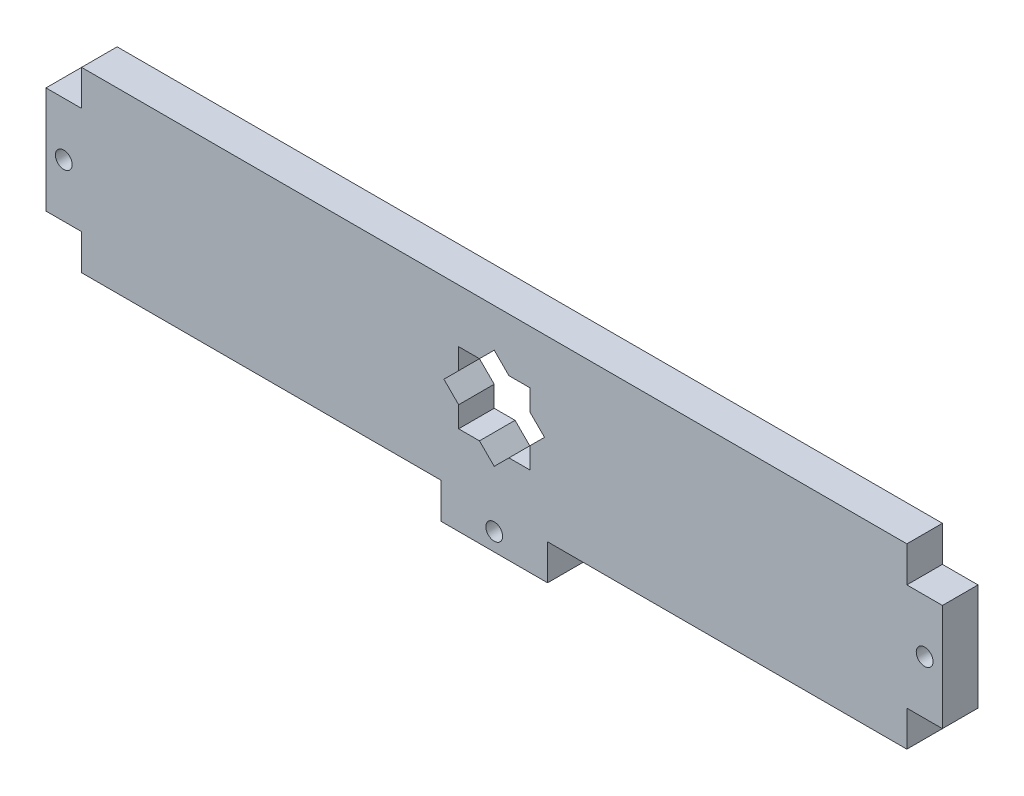
ISO-10303-21;
HEADER;
FILE_DESCRIPTION(('STEP AP214'),'2;1');
FILE_NAME('part.step','',(''),(''),'','','');
FILE_SCHEMA(('AUTOMOTIVE_DESIGN { 1 0 10303 214 1 1 1 1 }'));
ENDSEC;
DATA;
#1=APPLICATION_CONTEXT('core data for automotive mechanical design processes');
#2=APPLICATION_PROTOCOL_DEFINITION('international standard','automotive_design',2000,#1);
#3=PRODUCT_CONTEXT('',#1,'mechanical');
#4=PRODUCT('Part','Part','',(#3));
#5=PRODUCT_RELATED_PRODUCT_CATEGORY('part','',(#4));
#6=PRODUCT_DEFINITION_FORMATION('','',#4);
#7=PRODUCT_DEFINITION_CONTEXT('part definition',#1,'design');
#8=PRODUCT_DEFINITION('design','',#6,#7);
#9=PRODUCT_DEFINITION_SHAPE('','',#8);
#10=(LENGTH_UNIT() NAMED_UNIT(*) SI_UNIT(.MILLI.,.METRE.));
#11=(NAMED_UNIT(*) PLANE_ANGLE_UNIT() SI_UNIT($,.RADIAN.));
#12=(NAMED_UNIT(*) SI_UNIT($,.STERADIAN.) SOLID_ANGLE_UNIT());
#13=UNCERTAINTY_MEASURE_WITH_UNIT(LENGTH_MEASURE(1.E-05),#10,'distance_accuracy_value','');
#14=(GEOMETRIC_REPRESENTATION_CONTEXT(3) GLOBAL_UNCERTAINTY_ASSIGNED_CONTEXT((#13)) GLOBAL_UNIT_ASSIGNED_CONTEXT((#10,
#11,#12)) REPRESENTATION_CONTEXT('',''));
#15=CARTESIAN_POINT('',(0.,0.,0.));
#16=DIRECTION('',(0.,0.,1.));
#17=DIRECTION('',(1.,0.,0.));
#18=AXIS2_PLACEMENT_3D('',#15,#16,#17);
#19=CARTESIAN_POINT('',(-73.66,-15.875,-6.35));
#20=DIRECTION('',(0.,-1.,0.));
#21=DIRECTION('',(0.,0.,-1.));
#22=AXIS2_PLACEMENT_3D('',#19,#20,#21);
#23=PLANE('',#22);
#24=DIRECTION('',(1.,0.,0.));
#25=VECTOR('',#24,1.);
#26=CARTESIAN_POINT('',(-73.66,-15.875,-6.35));
#27=LINE('',#26,#25);
#28=CARTESIAN_POINT('',(-73.66,-15.875,-6.35));
#29=VERTEX_POINT('',#28);
#30=CARTESIAN_POINT('',(-9.52500000000007,-15.875,-6.35));
#31=VERTEX_POINT('',#30);
#32=EDGE_CURVE('E392',#29,#31,#27,.T.);
#33=ORIENTED_EDGE('',*,*,#32,.T.);
#34=DIRECTION('',(0.,0.,1.));
#35=VECTOR('',#34,1.);
#36=CARTESIAN_POINT('',(-9.52500000000007,-15.875,-6.35));
#37=LINE('',#36,#35);
#38=CARTESIAN_POINT('',(-9.52500000000007,-15.875,0.));
#39=VERTEX_POINT('',#38);
#40=EDGE_CURVE('E363',#31,#39,#37,.T.);
#41=ORIENTED_EDGE('',*,*,#40,.T.);
#42=DIRECTION('',(1.,0.,0.));
#43=VECTOR('',#42,1.);
#44=CARTESIAN_POINT('',(-73.66,-15.875,0.));
#45=LINE('',#44,#43);
#46=CARTESIAN_POINT('',(-73.66,-15.875,0.));
#47=VERTEX_POINT('',#46);
#48=EDGE_CURVE('E489',#47,#39,#45,.T.);
#49=ORIENTED_EDGE('',*,*,#48,.F.);
#50=DIRECTION('',(0.,0.,1.));
#51=VECTOR('',#50,1.);
#52=CARTESIAN_POINT('',(-73.66,-15.875,-6.35));
#53=LINE('',#52,#51);
#54=EDGE_CURVE('E42',#29,#47,#53,.T.);
#55=ORIENTED_EDGE('',*,*,#54,.F.);
#56=EDGE_LOOP('',(#33,#41,#49,#55));
#57=FACE_BOUND('',#56,.T.);
#58=ADVANCED_FACE('F33',(#57),#23,.T.);
#59=CARTESIAN_POINT('',(73.66,-15.875,-6.35));
#60=DIRECTION('',(1.,0.,0.));
#61=DIRECTION('',(0.,0.,-1.));
#62=AXIS2_PLACEMENT_3D('',#59,#60,#61);
#63=PLANE('',#62);
#64=DIRECTION('',(0.,1.,0.));
#65=VECTOR('',#64,1.);
#66=CARTESIAN_POINT('',(73.66,-15.875,-6.35));
#67=LINE('',#66,#65);
#68=CARTESIAN_POINT('',(73.66,-15.875,-6.35));
#69=VERTEX_POINT('',#68);
#70=CARTESIAN_POINT('',(73.66,-9.525,-6.35));
#71=VERTEX_POINT('',#70);
#72=EDGE_CURVE('E549',#69,#71,#67,.T.);
#73=ORIENTED_EDGE('',*,*,#72,.T.);
#74=DIRECTION('',(0.,0.,1.));
#75=VECTOR('',#74,1.);
#76=CARTESIAN_POINT('',(73.66,-9.525,-6.35));
#77=LINE('',#76,#75);
#78=CARTESIAN_POINT('',(73.66,-9.525,0.));
#79=VERTEX_POINT('',#78);
#80=EDGE_CURVE('E474',#71,#79,#77,.T.);
#81=ORIENTED_EDGE('',*,*,#80,.T.);
#82=DIRECTION('',(0.,1.,0.));
#83=VECTOR('',#82,1.);
#84=CARTESIAN_POINT('',(73.66,-15.875,0.));
#85=LINE('',#84,#83);
#86=CARTESIAN_POINT('',(73.66,-15.875,0.));
#87=VERTEX_POINT('',#86);
#88=EDGE_CURVE('E410',#87,#79,#85,.T.);
#89=ORIENTED_EDGE('',*,*,#88,.F.);
#90=DIRECTION('',(0.,0.,1.));
#91=VECTOR('',#90,1.);
#92=CARTESIAN_POINT('',(73.66,-15.875,-6.35));
#93=LINE('',#92,#91);
#94=EDGE_CURVE('E11',#69,#87,#93,.T.);
#95=ORIENTED_EDGE('',*,*,#94,.F.);
#96=EDGE_LOOP('',(#73,#81,#89,#95));
#97=FACE_BOUND('',#96,.T.);
#98=ADVANCED_FACE('F565',(#97),#63,.T.);
#99=CARTESIAN_POINT('',(-73.66,-15.875,-6.35));
#100=DIRECTION('',(-1.,0.,0.));
#101=DIRECTION('',(0.,0.,1.));
#102=AXIS2_PLACEMENT_3D('',#99,#100,#101);
#103=PLANE('',#102);
#104=DIRECTION('',(0.,-1.,0.));
#105=VECTOR('',#104,1.);
#106=CARTESIAN_POINT('',(-73.66,-15.875,-6.35));
#107=LINE('',#106,#105);
#108=CARTESIAN_POINT('',(-73.66,15.875,-6.35));
#109=VERTEX_POINT('',#108);
#110=CARTESIAN_POINT('',(-73.66,9.525,-6.35));
#111=VERTEX_POINT('',#110);
#112=EDGE_CURVE('E393',#109,#111,#107,.T.);
#113=ORIENTED_EDGE('',*,*,#112,.T.);
#114=DIRECTION('',(0.,0.,1.));
#115=VECTOR('',#114,1.);
#116=CARTESIAN_POINT('',(-73.66,9.525,-6.35));
#117=LINE('',#116,#115);
#118=CARTESIAN_POINT('',(-73.66,9.525,0.));
#119=VERTEX_POINT('',#118);
#120=EDGE_CURVE('E424',#111,#119,#117,.T.);
#121=ORIENTED_EDGE('',*,*,#120,.T.);
#122=DIRECTION('',(0.,-1.,0.));
#123=VECTOR('',#122,1.);
#124=CARTESIAN_POINT('',(-73.66,-15.875,0.));
#125=LINE('',#124,#123);
#126=CARTESIAN_POINT('',(-73.66,15.875,0.));
#127=VERTEX_POINT('',#126);
#128=EDGE_CURVE('E504',#127,#119,#125,.T.);
#129=ORIENTED_EDGE('',*,*,#128,.F.);
#130=DIRECTION('',(0.,0.,1.));
#131=VECTOR('',#130,1.);
#132=CARTESIAN_POINT('',(-73.66,15.875,-6.35));
#133=LINE('',#132,#131);
#134=EDGE_CURVE('E499',#109,#127,#133,.T.);
#135=ORIENTED_EDGE('',*,*,#134,.F.);
#136=EDGE_LOOP('',(#113,#121,#129,#135));
#137=FACE_BOUND('',#136,.T.);
#138=ADVANCED_FACE('F604',(#137),#103,.T.);
#139=DIRECTION('',(0.,0.,1.));
#140=VECTOR('',#139,1.);
#141=CARTESIAN_POINT('',(73.66,9.525,-6.35));
#142=LINE('',#141,#140);
#143=CARTESIAN_POINT('',(73.66,9.525,-6.35));
#144=VERTEX_POINT('',#143);
#145=CARTESIAN_POINT('',(73.66,9.525,0.));
#146=VERTEX_POINT('',#145);
#147=EDGE_CURVE('E465',#144,#146,#142,.T.);
#148=ORIENTED_EDGE('',*,*,#147,.F.);
#149=CARTESIAN_POINT('',(73.66,15.875,-6.35));
#150=VERTEX_POINT('',#149);
#151=EDGE_CURVE('E491',#144,#150,#67,.T.);
#152=ORIENTED_EDGE('',*,*,#151,.T.);
#153=DIRECTION('',(0.,0.,1.));
#154=VECTOR('',#153,1.);
#155=CARTESIAN_POINT('',(73.66,15.875,-6.35));
#156=LINE('',#155,#154);
#157=CARTESIAN_POINT('',(73.66,15.875,0.));
#158=VERTEX_POINT('',#157);
#159=EDGE_CURVE('E501',#150,#158,#156,.T.);
#160=ORIENTED_EDGE('',*,*,#159,.T.);
#161=EDGE_CURVE('E407',#146,#158,#85,.T.);
#162=ORIENTED_EDGE('',*,*,#161,.F.);
#163=EDGE_LOOP('',(#148,#152,#160,#162));
#164=FACE_BOUND('',#163,.T.);
#165=ADVANCED_FACE('F35',(#164),#63,.T.);
#166=DIRECTION('',(0.,0.,1.));
#167=VECTOR('',#166,1.);
#168=CARTESIAN_POINT('',(9.52499999999993,-15.875,-6.35));
#169=LINE('',#168,#167);
#170=CARTESIAN_POINT('',(9.52499999999993,-15.875,-6.35));
#171=VERTEX_POINT('',#170);
#172=CARTESIAN_POINT('',(9.52499999999993,-15.875,0.));
#173=VERTEX_POINT('',#172);
#174=EDGE_CURVE('E351',#171,#173,#169,.T.);
#175=ORIENTED_EDGE('',*,*,#174,.F.);
#176=EDGE_CURVE('E389',#171,#69,#27,.T.);
#177=ORIENTED_EDGE('',*,*,#176,.T.);
#178=ORIENTED_EDGE('',*,*,#94,.T.);
#179=EDGE_CURVE('E492',#173,#87,#45,.T.);
#180=ORIENTED_EDGE('',*,*,#179,.F.);
#181=EDGE_LOOP('',(#175,#177,#178,#180));
#182=FACE_BOUND('',#181,.T.);
#183=ADVANCED_FACE('F545',(#182),#23,.T.);
#184=DIRECTION('',(0.,0.,1.));
#185=VECTOR('',#184,1.);
#186=CARTESIAN_POINT('',(-73.66,-9.525,-6.35));
#187=LINE('',#186,#185);
#188=CARTESIAN_POINT('',(-73.66,-9.525,-6.35));
#189=VERTEX_POINT('',#188);
#190=CARTESIAN_POINT('',(-73.66,-9.525,0.));
#191=VERTEX_POINT('',#190);
#192=EDGE_CURVE('E426',#189,#191,#187,.T.);
#193=ORIENTED_EDGE('',*,*,#192,.F.);
#194=EDGE_CURVE('E511',#189,#29,#107,.T.);
#195=ORIENTED_EDGE('',*,*,#194,.T.);
#196=ORIENTED_EDGE('',*,*,#54,.T.);
#197=EDGE_CURVE('E507',#191,#47,#125,.T.);
#198=ORIENTED_EDGE('',*,*,#197,.F.);
#199=EDGE_LOOP('',(#193,#195,#196,#198));
#200=FACE_BOUND('',#199,.T.);
#201=ADVANCED_FACE('F525',(#200),#103,.T.);
#202=CARTESIAN_POINT('',(-73.66,15.875,-6.35));
#203=DIRECTION('',(0.,1.,0.));
#204=DIRECTION('',(0.,0.,1.));
#205=AXIS2_PLACEMENT_3D('',#202,#203,#204);
#206=PLANE('',#205);
#207=DIRECTION('',(-1.,0.,0.));
#208=VECTOR('',#207,1.);
#209=CARTESIAN_POINT('',(-73.66,15.875,0.));
#210=LINE('',#209,#208);
#211=EDGE_CURVE('E403',#158,#127,#210,.T.);
#212=ORIENTED_EDGE('',*,*,#211,.F.);
#213=ORIENTED_EDGE('',*,*,#159,.F.);
#214=DIRECTION('',(-1.,0.,0.));
#215=VECTOR('',#214,1.);
#216=CARTESIAN_POINT('',(-73.66,15.875,-6.35));
#217=LINE('',#216,#215);
#218=EDGE_CURVE('E512',#150,#109,#217,.T.);
#219=ORIENTED_EDGE('',*,*,#218,.T.);
#220=ORIENTED_EDGE('',*,*,#134,.T.);
#221=EDGE_LOOP('',(#212,#213,#219,#220));
#222=FACE_BOUND('',#221,.T.);
#223=ADVANCED_FACE('F611',(#222),#206,.T.);
#224=CARTESIAN_POINT('',(0.,0.,-6.35));
#225=DIRECTION('',(0.,0.,-1.));
#226=DIRECTION('',(-1.,0.,0.));
#227=AXIS2_PLACEMENT_3D('',#224,#225,#226);
#228=PLANE('',#227);
#229=DIRECTION('',(-0.707106781186547,0.707106781186548,0.));
#230=VECTOR('',#229,1.);
#231=CARTESIAN_POINT('',(2.63025612106915,6.35,-6.35));
#232=LINE('',#231,#230);
#233=CARTESIAN_POINT('',(2.63025612106915,6.35,-6.35));
#234=VERTEX_POINT('',#233);
#235=CARTESIAN_POINT('',(0.,8.98025612106915,-6.35));
#236=VERTEX_POINT('',#235);
#237=EDGE_CURVE('E258',#234,#236,#232,.T.);
#238=ORIENTED_EDGE('',*,*,#237,.T.);
#239=DIRECTION('',(-0.707106781186547,-0.707106781186548,0.));
#240=VECTOR('',#239,1.);
#241=CARTESIAN_POINT('',(-2.63025612106915,6.35,-6.35));
#242=LINE('',#241,#240);
#243=CARTESIAN_POINT('',(-2.63025612106915,6.35,-6.35));
#244=VERTEX_POINT('',#243);
#245=EDGE_CURVE('E245',#236,#244,#242,.T.);
#246=ORIENTED_EDGE('',*,*,#245,.T.);
#247=DIRECTION('',(-1.,0.,0.));
#248=VECTOR('',#247,1.);
#249=CARTESIAN_POINT('',(-6.35,6.35,-6.35));
#250=LINE('',#249,#248);
#251=CARTESIAN_POINT('',(-6.35,6.35,-6.35));
#252=VERTEX_POINT('',#251);
#253=EDGE_CURVE('E324',#244,#252,#250,.T.);
#254=ORIENTED_EDGE('',*,*,#253,.T.);
#255=DIRECTION('',(0.,-1.,0.));
#256=VECTOR('',#255,1.);
#257=CARTESIAN_POINT('',(-6.35,6.35,-6.35));
#258=LINE('',#257,#256);
#259=CARTESIAN_POINT('',(-6.35,2.63025612106915,-6.35));
#260=VERTEX_POINT('',#259);
#261=EDGE_CURVE('E320',#252,#260,#258,.T.);
#262=ORIENTED_EDGE('',*,*,#261,.T.);
#263=DIRECTION('',(-0.707106781186547,-0.707106781186548,0.));
#264=VECTOR('',#263,1.);
#265=CARTESIAN_POINT('',(-8.98025612106915,0.,-6.35));
#266=LINE('',#265,#264);
#267=CARTESIAN_POINT('',(-8.98025612106915,0.,-6.35));
#268=VERTEX_POINT('',#267);
#269=EDGE_CURVE('E316',#260,#268,#266,.T.);
#270=ORIENTED_EDGE('',*,*,#269,.T.);
#271=DIRECTION('',(0.707106781186548,-0.707106781186547,0.));
#272=VECTOR('',#271,1.);
#273=CARTESIAN_POINT('',(-6.35,-2.63025612106916,-6.35));
#274=LINE('',#273,#272);
#275=CARTESIAN_POINT('',(-6.35,-2.63025612106916,-6.35));
#276=VERTEX_POINT('',#275);
#277=EDGE_CURVE('E312',#268,#276,#274,.T.);
#278=ORIENTED_EDGE('',*,*,#277,.T.);
#279=DIRECTION('',(0.,-1.,0.));
#280=VECTOR('',#279,1.);
#281=CARTESIAN_POINT('',(-6.35,-6.35,-6.35));
#282=LINE('',#281,#280);
#283=CARTESIAN_POINT('',(-6.35,-6.35,-6.35));
#284=VERTEX_POINT('',#283);
#285=EDGE_CURVE('E308',#276,#284,#282,.T.);
#286=ORIENTED_EDGE('',*,*,#285,.T.);
#287=DIRECTION('',(1.,0.,0.));
#288=VECTOR('',#287,1.);
#289=CARTESIAN_POINT('',(-6.35,-6.35,-6.35));
#290=LINE('',#289,#288);
#291=CARTESIAN_POINT('',(-2.63025612106916,-6.35,-6.35));
#292=VERTEX_POINT('',#291);
#293=EDGE_CURVE('E304',#284,#292,#290,.T.);
#294=ORIENTED_EDGE('',*,*,#293,.T.);
#295=DIRECTION('',(0.707106781186548,-0.707106781186547,0.));
#296=VECTOR('',#295,1.);
#297=CARTESIAN_POINT('',(0.,-8.98025612106916,-6.35));
#298=LINE('',#297,#296);
#299=CARTESIAN_POINT('',(0.,-8.98025612106916,-6.35));
#300=VERTEX_POINT('',#299);
#301=EDGE_CURVE('E300',#292,#300,#298,.T.);
#302=ORIENTED_EDGE('',*,*,#301,.T.);
#303=DIRECTION('',(0.707106781186547,0.707106781186548,0.));
#304=VECTOR('',#303,1.);
#305=CARTESIAN_POINT('',(0.,-8.98025612106916,-6.35));
#306=LINE('',#305,#304);
#307=CARTESIAN_POINT('',(2.63025612106915,-6.35,-6.35));
#308=VERTEX_POINT('',#307);
#309=EDGE_CURVE('E296',#300,#308,#306,.T.);
#310=ORIENTED_EDGE('',*,*,#309,.T.);
#311=DIRECTION('',(1.,0.,0.));
#312=VECTOR('',#311,1.);
#313=CARTESIAN_POINT('',(2.63025612106915,-6.35,-6.35));
#314=LINE('',#313,#312);
#315=CARTESIAN_POINT('',(6.35,-6.35,-6.35));
#316=VERTEX_POINT('',#315);
#317=EDGE_CURVE('E292',#308,#316,#314,.T.);
#318=ORIENTED_EDGE('',*,*,#317,.T.);
#319=DIRECTION('',(0.,1.,0.));
#320=VECTOR('',#319,1.);
#321=CARTESIAN_POINT('',(6.35,-6.35,-6.35));
#322=LINE('',#321,#320);
#323=CARTESIAN_POINT('',(6.35,-2.63025612106915,-6.35));
#324=VERTEX_POINT('',#323);
#325=EDGE_CURVE('E288',#316,#324,#322,.T.);
#326=ORIENTED_EDGE('',*,*,#325,.T.);
#327=DIRECTION('',(0.707106781186548,0.707106781186547,0.));
#328=VECTOR('',#327,1.);
#329=CARTESIAN_POINT('',(6.35,-2.63025612106915,-6.35));
#330=LINE('',#329,#328);
#331=CARTESIAN_POINT('',(8.98025612106916,0.,-6.35));
#332=VERTEX_POINT('',#331);
#333=EDGE_CURVE('E284',#324,#332,#330,.T.);
#334=ORIENTED_EDGE('',*,*,#333,.T.);
#335=DIRECTION('',(-0.707106781186547,0.707106781186548,0.));
#336=VECTOR('',#335,1.);
#337=CARTESIAN_POINT('',(8.98025612106916,0.,-6.35));
#338=LINE('',#337,#336);
#339=CARTESIAN_POINT('',(6.35,2.63025612106915,-6.35));
#340=VERTEX_POINT('',#339);
#341=EDGE_CURVE('E280',#332,#340,#338,.T.);
#342=ORIENTED_EDGE('',*,*,#341,.T.);
#343=DIRECTION('',(0.,1.,0.));
#344=VECTOR('',#343,1.);
#345=CARTESIAN_POINT('',(6.35,2.63025612106915,-6.35));
#346=LINE('',#345,#344);
#347=CARTESIAN_POINT('',(6.35,6.35,-6.35));
#348=VERTEX_POINT('',#347);
#349=EDGE_CURVE('E277',#340,#348,#346,.T.);
#350=ORIENTED_EDGE('',*,*,#349,.T.);
#351=DIRECTION('',(-1.,0.,0.));
#352=VECTOR('',#351,1.);
#353=CARTESIAN_POINT('',(2.63025612106915,6.35,-6.35));
#354=LINE('',#353,#352);
#355=EDGE_CURVE('E267',#348,#234,#354,.T.);
#356=ORIENTED_EDGE('',*,*,#355,.T.);
#357=EDGE_LOOP('',(#238,#246,#254,#262,#270,#278,#286,#294,#302,#310,#318,#326,#334,#342,#350,#356));
#358=FACE_BOUND('',#357,.T.);
#359=ORIENTED_EDGE('',*,*,#72,.F.);
#360=ORIENTED_EDGE('',*,*,#176,.F.);
#361=DIRECTION('',(0.,1.,0.));
#362=VECTOR('',#361,1.);
#363=CARTESIAN_POINT('',(9.52499999999993,-22.225,-6.35));
#364=LINE('',#363,#362);
#365=CARTESIAN_POINT('',(9.52499999999993,-22.225,-6.35));
#366=VERTEX_POINT('',#365);
#367=EDGE_CURVE('E356',#366,#171,#364,.T.);
#368=ORIENTED_EDGE('',*,*,#367,.F.);
#369=DIRECTION('',(1.,0.,0.));
#370=VECTOR('',#369,1.);
#371=CARTESIAN_POINT('',(-9.52500000000007,-22.225,-6.35));
#372=LINE('',#371,#370);
#373=CARTESIAN_POINT('',(-9.52500000000007,-22.225,-6.35));
#374=VERTEX_POINT('',#373);
#375=EDGE_CURVE('E348',#374,#366,#372,.T.);
#376=ORIENTED_EDGE('',*,*,#375,.F.);
#377=DIRECTION('',(0.,-1.,0.));
#378=VECTOR('',#377,1.);
#379=CARTESIAN_POINT('',(-9.52500000000007,-22.225,-6.35));
#380=LINE('',#379,#378);
#381=EDGE_CURVE('E352',#31,#374,#380,.T.);
#382=ORIENTED_EDGE('',*,*,#381,.F.);
#383=ORIENTED_EDGE('',*,*,#32,.F.);
#384=ORIENTED_EDGE('',*,*,#194,.F.);
#385=DIRECTION('',(1.,0.,0.));
#386=VECTOR('',#385,1.);
#387=CARTESIAN_POINT('',(-80.01,-9.525,-6.35));
#388=LINE('',#387,#386);
#389=CARTESIAN_POINT('',(-80.01,-9.525,-6.35));
#390=VERTEX_POINT('',#389);
#391=EDGE_CURVE('E422',#390,#189,#388,.T.);
#392=ORIENTED_EDGE('',*,*,#391,.F.);
#393=DIRECTION('',(0.,-1.,0.));
#394=VECTOR('',#393,1.);
#395=CARTESIAN_POINT('',(-80.01,-9.525,-6.35));
#396=LINE('',#395,#394);
#397=CARTESIAN_POINT('',(-80.01,9.525,-6.35));
#398=VERTEX_POINT('',#397);
#399=EDGE_CURVE('E425',#398,#390,#396,.T.);
#400=ORIENTED_EDGE('',*,*,#399,.F.);
#401=DIRECTION('',(-1.,0.,0.));
#402=VECTOR('',#401,1.);
#403=CARTESIAN_POINT('',(-80.01,9.525,-6.35));
#404=LINE('',#403,#402);
#405=EDGE_CURVE('E418',#111,#398,#404,.T.);
#406=ORIENTED_EDGE('',*,*,#405,.F.);
#407=ORIENTED_EDGE('',*,*,#112,.F.);
#408=ORIENTED_EDGE('',*,*,#218,.F.);
#409=ORIENTED_EDGE('',*,*,#151,.F.);
#410=DIRECTION('',(-1.,0.,0.));
#411=VECTOR('',#410,1.);
#412=CARTESIAN_POINT('',(80.01,9.525,-6.35));
#413=LINE('',#412,#411);
#414=CARTESIAN_POINT('',(80.01,9.525,-6.35));
#415=VERTEX_POINT('',#414);
#416=EDGE_CURVE('E477',#415,#144,#413,.T.);
#417=ORIENTED_EDGE('',*,*,#416,.F.);
#418=DIRECTION('',(0.,1.,0.));
#419=VECTOR('',#418,1.);
#420=CARTESIAN_POINT('',(80.01,-9.525,-6.35));
#421=LINE('',#420,#419);
#422=CARTESIAN_POINT('',(80.01,-9.525,-6.35));
#423=VERTEX_POINT('',#422);
#424=EDGE_CURVE('E479',#423,#415,#421,.T.);
#425=ORIENTED_EDGE('',*,*,#424,.F.);
#426=DIRECTION('',(1.,0.,0.));
#427=VECTOR('',#426,1.);
#428=CARTESIAN_POINT('',(80.01,-9.525,-6.35));
#429=LINE('',#428,#427);
#430=EDGE_CURVE('E466',#71,#423,#429,.T.);
#431=ORIENTED_EDGE('',*,*,#430,.F.);
#432=EDGE_LOOP('',(#359,#360,#368,#376,#382,#383,#384,#392,#400,#406,#407,#408,#409,#417,#425,#431));
#433=FACE_BOUND('',#432,.T.);
#434=CARTESIAN_POINT('',(-76.835,0.,-6.35));
#435=DIRECTION('',(0.,0.,1.));
#436=DIRECTION('',(1.,0.,0.));
#437=AXIS2_PLACEMENT_3D('',#434,#435,#436);
#438=CIRCLE('',#437,1.5);
#439=CARTESIAN_POINT('',(-75.335,0.,-6.35));
#440=VERTEX_POINT('',#439);
#441=EDGE_CURVE('E458',#440,#440,#438,.T.);
#442=ORIENTED_EDGE('',*,*,#441,.T.);
#443=EDGE_LOOP('',(#442));
#444=FACE_BOUND('',#443,.T.);
#445=CARTESIAN_POINT('',(76.835,0.,-6.35));
#446=DIRECTION('',(0.,0.,1.));
#447=DIRECTION('',(-1.,0.,0.));
#448=AXIS2_PLACEMENT_3D('',#445,#446,#447);
#449=CIRCLE('',#448,1.5);
#450=CARTESIAN_POINT('',(75.335,0.,-6.35));
#451=VERTEX_POINT('',#450);
#452=EDGE_CURVE('E570',#451,#451,#449,.T.);
#453=ORIENTED_EDGE('',*,*,#452,.T.);
#454=EDGE_LOOP('',(#453));
#455=FACE_BOUND('',#454,.T.);
#456=CARTESIAN_POINT('',(0.,-19.05,-6.35));
#457=DIRECTION('',(0.,0.,1.));
#458=DIRECTION('',(1.,0.,0.));
#459=AXIS2_PLACEMENT_3D('',#456,#457,#458);
#460=CIRCLE('',#459,1.5);
#461=CARTESIAN_POINT('',(1.49999999999993,-19.05,-6.35));
#462=VERTEX_POINT('',#461);
#463=EDGE_CURVE('E342',#462,#462,#460,.T.);
#464=ORIENTED_EDGE('',*,*,#463,.T.);
#465=EDGE_LOOP('',(#464));
#466=FACE_BOUND('',#465,.T.);
#467=ADVANCED_FACE('F264',(#358,#433,#444,#455,#466),#228,.T.);
#468=CARTESIAN_POINT('',(0.,0.,0.));
#469=DIRECTION('',(0.,0.,-1.));
#470=DIRECTION('',(-1.,0.,0.));
#471=AXIS2_PLACEMENT_3D('',#468,#469,#470);
#472=PLANE('',#471);
#473=DIRECTION('',(-0.707106781186547,-0.707106781186548,0.));
#474=VECTOR('',#473,1.);
#475=CARTESIAN_POINT('',(-2.63025612106915,6.35,0.));
#476=LINE('',#475,#474);
#477=CARTESIAN_POINT('',(0.,8.98025612106915,0.));
#478=VERTEX_POINT('',#477);
#479=CARTESIAN_POINT('',(-2.63025612106915,6.35,0.));
#480=VERTEX_POINT('',#479);
#481=EDGE_CURVE('E908',#478,#480,#476,.T.);
#482=ORIENTED_EDGE('',*,*,#481,.F.);
#483=DIRECTION('',(-0.707106781186547,0.707106781186548,0.));
#484=VECTOR('',#483,1.);
#485=CARTESIAN_POINT('',(2.63025612106915,6.35,0.));
#486=LINE('',#485,#484);
#487=CARTESIAN_POINT('',(2.63025612106915,6.35,0.));
#488=VERTEX_POINT('',#487);
#489=EDGE_CURVE('E261',#488,#478,#486,.T.);
#490=ORIENTED_EDGE('',*,*,#489,.F.);
#491=DIRECTION('',(-1.,0.,0.));
#492=VECTOR('',#491,1.);
#493=CARTESIAN_POINT('',(2.63025612106915,6.35,0.));
#494=LINE('',#493,#492);
#495=CARTESIAN_POINT('',(6.35,6.35,0.));
#496=VERTEX_POINT('',#495);
#497=EDGE_CURVE('E273',#496,#488,#494,.T.);
#498=ORIENTED_EDGE('',*,*,#497,.F.);
#499=DIRECTION('',(0.,1.,0.));
#500=VECTOR('',#499,1.);
#501=CARTESIAN_POINT('',(6.35,2.63025612106915,0.));
#502=LINE('',#501,#500);
#503=CARTESIAN_POINT('',(6.35,2.63025612106915,0.));
#504=VERTEX_POINT('',#503);
#505=EDGE_CURVE('E58',#504,#496,#502,.T.);
#506=ORIENTED_EDGE('',*,*,#505,.F.);
#507=DIRECTION('',(-0.707106781186547,0.707106781186548,0.));
#508=VECTOR('',#507,1.);
#509=CARTESIAN_POINT('',(8.98025612106916,0.,0.));
#510=LINE('',#509,#508);
#511=CARTESIAN_POINT('',(8.98025612106916,0.,0.));
#512=VERTEX_POINT('',#511);
#513=EDGE_CURVE('E269',#512,#504,#510,.T.);
#514=ORIENTED_EDGE('',*,*,#513,.F.);
#515=DIRECTION('',(0.707106781186548,0.707106781186547,0.));
#516=VECTOR('',#515,1.);
#517=CARTESIAN_POINT('',(6.35,-2.63025612106915,0.));
#518=LINE('',#517,#516);
#519=CARTESIAN_POINT('',(6.35,-2.63025612106915,0.));
#520=VERTEX_POINT('',#519);
#521=EDGE_CURVE('E941',#520,#512,#518,.T.);
#522=ORIENTED_EDGE('',*,*,#521,.F.);
#523=DIRECTION('',(0.,1.,0.));
#524=VECTOR('',#523,1.);
#525=CARTESIAN_POINT('',(6.35,-6.35,0.));
#526=LINE('',#525,#524);
#527=CARTESIAN_POINT('',(6.35,-6.35,0.));
#528=VERTEX_POINT('',#527);
#529=EDGE_CURVE('E938',#528,#520,#526,.T.);
#530=ORIENTED_EDGE('',*,*,#529,.F.);
#531=DIRECTION('',(1.,0.,0.));
#532=VECTOR('',#531,1.);
#533=CARTESIAN_POINT('',(2.63025612106915,-6.35,0.));
#534=LINE('',#533,#532);
#535=CARTESIAN_POINT('',(2.63025612106915,-6.35,0.));
#536=VERTEX_POINT('',#535);
#537=EDGE_CURVE('E935',#536,#528,#534,.T.);
#538=ORIENTED_EDGE('',*,*,#537,.F.);
#539=DIRECTION('',(0.707106781186547,0.707106781186548,0.));
#540=VECTOR('',#539,1.);
#541=CARTESIAN_POINT('',(0.,-8.98025612106916,0.));
#542=LINE('',#541,#540);
#543=CARTESIAN_POINT('',(0.,-8.98025612106916,0.));
#544=VERTEX_POINT('',#543);
#545=EDGE_CURVE('E932',#544,#536,#542,.T.);
#546=ORIENTED_EDGE('',*,*,#545,.F.);
#547=DIRECTION('',(0.707106781186548,-0.707106781186547,0.));
#548=VECTOR('',#547,1.);
#549=CARTESIAN_POINT('',(0.,-8.98025612106916,0.));
#550=LINE('',#549,#548);
#551=CARTESIAN_POINT('',(-2.63025612106916,-6.35,0.));
#552=VERTEX_POINT('',#551);
#553=EDGE_CURVE('E929',#552,#544,#550,.T.);
#554=ORIENTED_EDGE('',*,*,#553,.F.);
#555=DIRECTION('',(1.,0.,0.));
#556=VECTOR('',#555,1.);
#557=CARTESIAN_POINT('',(-6.35,-6.35,0.));
#558=LINE('',#557,#556);
#559=CARTESIAN_POINT('',(-6.35,-6.35,0.));
#560=VERTEX_POINT('',#559);
#561=EDGE_CURVE('E926',#560,#552,#558,.T.);
#562=ORIENTED_EDGE('',*,*,#561,.F.);
#563=DIRECTION('',(0.,-1.,0.));
#564=VECTOR('',#563,1.);
#565=CARTESIAN_POINT('',(-6.35,-6.35,0.));
#566=LINE('',#565,#564);
#567=CARTESIAN_POINT('',(-6.35,-2.63025612106916,0.));
#568=VERTEX_POINT('',#567);
#569=EDGE_CURVE('E923',#568,#560,#566,.T.);
#570=ORIENTED_EDGE('',*,*,#569,.F.);
#571=DIRECTION('',(0.707106781186548,-0.707106781186547,0.));
#572=VECTOR('',#571,1.);
#573=CARTESIAN_POINT('',(-6.35,-2.63025612106916,0.));
#574=LINE('',#573,#572);
#575=CARTESIAN_POINT('',(-8.98025612106915,0.,0.));
#576=VERTEX_POINT('',#575);
#577=EDGE_CURVE('E920',#576,#568,#574,.T.);
#578=ORIENTED_EDGE('',*,*,#577,.F.);
#579=DIRECTION('',(-0.707106781186547,-0.707106781186548,0.));
#580=VECTOR('',#579,1.);
#581=CARTESIAN_POINT('',(-8.98025612106915,0.,0.));
#582=LINE('',#581,#580);
#583=CARTESIAN_POINT('',(-6.35,2.63025612106915,0.));
#584=VERTEX_POINT('',#583);
#585=EDGE_CURVE('E917',#584,#576,#582,.T.);
#586=ORIENTED_EDGE('',*,*,#585,.F.);
#587=DIRECTION('',(0.,-1.,0.));
#588=VECTOR('',#587,1.);
#589=CARTESIAN_POINT('',(-6.35,6.35,0.));
#590=LINE('',#589,#588);
#591=CARTESIAN_POINT('',(-6.35,6.35,0.));
#592=VERTEX_POINT('',#591);
#593=EDGE_CURVE('E914',#592,#584,#590,.T.);
#594=ORIENTED_EDGE('',*,*,#593,.F.);
#595=DIRECTION('',(-1.,0.,0.));
#596=VECTOR('',#595,1.);
#597=CARTESIAN_POINT('',(-6.35,6.35,0.));
#598=LINE('',#597,#596);
#599=EDGE_CURVE('E909',#480,#592,#598,.T.);
#600=ORIENTED_EDGE('',*,*,#599,.F.);
#601=EDGE_LOOP('',(#482,#490,#498,#506,#514,#522,#530,#538,#546,#554,#562,#570,#578,#586,#594,#600));
#602=FACE_BOUND('',#601,.T.);
#603=ORIENTED_EDGE('',*,*,#88,.T.);
#604=DIRECTION('',(1.,0.,0.));
#605=VECTOR('',#604,1.);
#606=CARTESIAN_POINT('',(80.01,-9.525,0.));
#607=LINE('',#606,#605);
#608=CARTESIAN_POINT('',(80.01,-9.525,0.));
#609=VERTEX_POINT('',#608);
#610=EDGE_CURVE('E485',#79,#609,#607,.T.);
#611=ORIENTED_EDGE('',*,*,#610,.T.);
#612=DIRECTION('',(0.,1.,0.));
#613=VECTOR('',#612,1.);
#614=CARTESIAN_POINT('',(80.01,-9.525,0.));
#615=LINE('',#614,#613);
#616=CARTESIAN_POINT('',(80.01,9.525,0.));
#617=VERTEX_POINT('',#616);
#618=EDGE_CURVE('E486',#609,#617,#615,.T.);
#619=ORIENTED_EDGE('',*,*,#618,.T.);
#620=DIRECTION('',(-1.,0.,0.));
#621=VECTOR('',#620,1.);
#622=CARTESIAN_POINT('',(80.01,9.525,0.));
#623=LINE('',#622,#621);
#624=EDGE_CURVE('E482',#617,#146,#623,.T.);
#625=ORIENTED_EDGE('',*,*,#624,.T.);
#626=ORIENTED_EDGE('',*,*,#161,.T.);
#627=ORIENTED_EDGE('',*,*,#211,.T.);
#628=ORIENTED_EDGE('',*,*,#128,.T.);
#629=DIRECTION('',(-1.,0.,0.));
#630=VECTOR('',#629,1.);
#631=CARTESIAN_POINT('',(-80.01,9.525,0.));
#632=LINE('',#631,#630);
#633=CARTESIAN_POINT('',(-80.01,9.525,0.));
#634=VERTEX_POINT('',#633);
#635=EDGE_CURVE('E462',#119,#634,#632,.T.);
#636=ORIENTED_EDGE('',*,*,#635,.T.);
#637=DIRECTION('',(0.,-1.,0.));
#638=VECTOR('',#637,1.);
#639=CARTESIAN_POINT('',(-80.01,-9.525,0.));
#640=LINE('',#639,#638);
#641=CARTESIAN_POINT('',(-80.01,-9.525,0.));
#642=VERTEX_POINT('',#641);
#643=EDGE_CURVE('E419',#634,#642,#640,.T.);
#644=ORIENTED_EDGE('',*,*,#643,.T.);
#645=DIRECTION('',(1.,0.,0.));
#646=VECTOR('',#645,1.);
#647=CARTESIAN_POINT('',(-80.01,-9.525,0.));
#648=LINE('',#647,#646);
#649=EDGE_CURVE('E415',#642,#191,#648,.T.);
#650=ORIENTED_EDGE('',*,*,#649,.T.);
#651=ORIENTED_EDGE('',*,*,#197,.T.);
#652=ORIENTED_EDGE('',*,*,#48,.T.);
#653=DIRECTION('',(0.,-1.,0.));
#654=VECTOR('',#653,1.);
#655=CARTESIAN_POINT('',(-9.52500000000007,-22.225,0.));
#656=LINE('',#655,#654);
#657=CARTESIAN_POINT('',(-9.52500000000007,-22.225,0.));
#658=VERTEX_POINT('',#657);
#659=EDGE_CURVE('E357',#39,#658,#656,.T.);
#660=ORIENTED_EDGE('',*,*,#659,.T.);
#661=DIRECTION('',(1.,0.,0.));
#662=VECTOR('',#661,1.);
#663=CARTESIAN_POINT('',(-9.52500000000007,-22.225,0.));
#664=LINE('',#663,#662);
#665=CARTESIAN_POINT('',(9.52499999999993,-22.225,0.));
#666=VERTEX_POINT('',#665);
#667=EDGE_CURVE('E353',#658,#666,#664,.T.);
#668=ORIENTED_EDGE('',*,*,#667,.T.);
#669=DIRECTION('',(0.,1.,0.));
#670=VECTOR('',#669,1.);
#671=CARTESIAN_POINT('',(9.52499999999993,-22.225,0.));
#672=LINE('',#671,#670);
#673=EDGE_CURVE('E345',#666,#173,#672,.T.);
#674=ORIENTED_EDGE('',*,*,#673,.T.);
#675=ORIENTED_EDGE('',*,*,#179,.T.);
#676=EDGE_LOOP('',(#603,#611,#619,#625,#626,#627,#628,#636,#644,#650,#651,#652,#660,#668,#674,#675));
#677=FACE_BOUND('',#676,.T.);
#678=CARTESIAN_POINT('',(-76.835,0.,0.));
#679=DIRECTION('',(0.,0.,1.));
#680=DIRECTION('',(1.,0.,0.));
#681=AXIS2_PLACEMENT_3D('',#678,#679,#680);
#682=CIRCLE('',#681,1.5);
#683=CARTESIAN_POINT('',(-75.335,0.,0.));
#684=VERTEX_POINT('',#683);
#685=EDGE_CURVE('E455',#684,#684,#682,.T.);
#686=ORIENTED_EDGE('',*,*,#685,.F.);
#687=EDGE_LOOP('',(#686));
#688=FACE_BOUND('',#687,.T.);
#689=CARTESIAN_POINT('',(76.835,0.,0.));
#690=DIRECTION('',(0.,0.,1.));
#691=DIRECTION('',(-1.,0.,0.));
#692=AXIS2_PLACEMENT_3D('',#689,#690,#691);
#693=CIRCLE('',#692,1.5);
#694=CARTESIAN_POINT('',(75.335,0.,0.));
#695=VERTEX_POINT('',#694);
#696=EDGE_CURVE('E360',#695,#695,#693,.T.);
#697=ORIENTED_EDGE('',*,*,#696,.F.);
#698=EDGE_LOOP('',(#697));
#699=FACE_BOUND('',#698,.T.);
#700=CARTESIAN_POINT('',(0.,-19.05,0.));
#701=DIRECTION('',(0.,0.,1.));
#702=DIRECTION('',(1.,0.,0.));
#703=AXIS2_PLACEMENT_3D('',#700,#701,#702);
#704=CIRCLE('',#703,1.5);
#705=CARTESIAN_POINT('',(1.49999999999993,-19.05,0.));
#706=VERTEX_POINT('',#705);
#707=EDGE_CURVE('E341',#706,#706,#704,.T.);
#708=ORIENTED_EDGE('',*,*,#707,.F.);
#709=EDGE_LOOP('',(#708));
#710=FACE_BOUND('',#709,.T.);
#711=ADVANCED_FACE('F517',(#602,#677,#688,#699,#710),#472,.F.);
#712=CARTESIAN_POINT('',(-80.01,-9.525,-6.35));
#713=DIRECTION('',(0.,-1.,0.));
#714=DIRECTION('',(0.,0.,-1.));
#715=AXIS2_PLACEMENT_3D('',#712,#713,#714);
#716=PLANE('',#715);
#717=ORIENTED_EDGE('',*,*,#649,.F.);
#718=DIRECTION('',(0.,0.,1.));
#719=VECTOR('',#718,1.);
#720=CARTESIAN_POINT('',(-80.01,-9.525,-6.35));
#721=LINE('',#720,#719);
#722=EDGE_CURVE('E429',#390,#642,#721,.T.);
#723=ORIENTED_EDGE('',*,*,#722,.F.);
#724=ORIENTED_EDGE('',*,*,#391,.T.);
#725=ORIENTED_EDGE('',*,*,#192,.T.);
#726=EDGE_LOOP('',(#717,#723,#724,#725));
#727=FACE_BOUND('',#726,.T.);
#728=ADVANCED_FACE('F521',(#727),#716,.T.);
#729=CARTESIAN_POINT('',(-80.01,-9.525,-6.35));
#730=DIRECTION('',(-1.,0.,0.));
#731=DIRECTION('',(0.,0.,1.));
#732=AXIS2_PLACEMENT_3D('',#729,#730,#731);
#733=PLANE('',#732);
#734=ORIENTED_EDGE('',*,*,#643,.F.);
#735=DIRECTION('',(0.,0.,1.));
#736=VECTOR('',#735,1.);
#737=CARTESIAN_POINT('',(-80.01,9.525,-6.35));
#738=LINE('',#737,#736);
#739=EDGE_CURVE('E437',#398,#634,#738,.T.);
#740=ORIENTED_EDGE('',*,*,#739,.F.);
#741=ORIENTED_EDGE('',*,*,#399,.T.);
#742=ORIENTED_EDGE('',*,*,#722,.T.);
#743=EDGE_LOOP('',(#734,#740,#741,#742));
#744=FACE_BOUND('',#743,.T.);
#745=ADVANCED_FACE('F629',(#744),#733,.T.);
#746=CARTESIAN_POINT('',(-80.01,9.525,-6.35));
#747=DIRECTION('',(0.,1.,0.));
#748=DIRECTION('',(0.,0.,1.));
#749=AXIS2_PLACEMENT_3D('',#746,#747,#748);
#750=PLANE('',#749);
#751=ORIENTED_EDGE('',*,*,#635,.F.);
#752=ORIENTED_EDGE('',*,*,#120,.F.);
#753=ORIENTED_EDGE('',*,*,#405,.T.);
#754=ORIENTED_EDGE('',*,*,#739,.T.);
#755=EDGE_LOOP('',(#751,#752,#753,#754));
#756=FACE_BOUND('',#755,.T.);
#757=ADVANCED_FACE('F628',(#756),#750,.T.);
#758=CARTESIAN_POINT('',(-76.835,0.,-6.35));
#759=DIRECTION('',(0.,0.,1.));
#760=DIRECTION('',(1.,0.,0.));
#761=AXIS2_PLACEMENT_3D('',#758,#759,#760);
#762=CYLINDRICAL_SURFACE('',#761,1.5);
#763=ORIENTED_EDGE('',*,*,#441,.F.);
#764=EDGE_LOOP('',(#763));
#765=FACE_BOUND('',#764,.T.);
#766=ORIENTED_EDGE('',*,*,#685,.T.);
#767=EDGE_LOOP('',(#766));
#768=FACE_BOUND('',#767,.T.);
#769=ADVANCED_FACE('F636',(#765,#768),#762,.F.);
#770=CARTESIAN_POINT('',(80.01,-9.525,-6.35));
#771=DIRECTION('',(1.,0.,0.));
#772=DIRECTION('',(0.,0.,-1.));
#773=AXIS2_PLACEMENT_3D('',#770,#771,#772);
#774=PLANE('',#773);
#775=ORIENTED_EDGE('',*,*,#618,.F.);
#776=DIRECTION('',(0.,0.,1.));
#777=VECTOR('',#776,1.);
#778=CARTESIAN_POINT('',(80.01,-9.525,-6.35));
#779=LINE('',#778,#777);
#780=EDGE_CURVE('E459',#423,#609,#779,.T.);
#781=ORIENTED_EDGE('',*,*,#780,.F.);
#782=ORIENTED_EDGE('',*,*,#424,.T.);
#783=DIRECTION('',(0.,0.,1.));
#784=VECTOR('',#783,1.);
#785=CARTESIAN_POINT('',(80.01,9.525,-6.35));
#786=LINE('',#785,#784);
#787=EDGE_CURVE('E463',#415,#617,#786,.T.);
#788=ORIENTED_EDGE('',*,*,#787,.T.);
#789=EDGE_LOOP('',(#775,#781,#782,#788));
#790=FACE_BOUND('',#789,.T.);
#791=ADVANCED_FACE('F679',(#790),#774,.T.);
#792=CARTESIAN_POINT('',(80.01,-9.525,-6.35));
#793=DIRECTION('',(0.,-1.,0.));
#794=DIRECTION('',(0.,0.,-1.));
#795=AXIS2_PLACEMENT_3D('',#792,#793,#794);
#796=PLANE('',#795);
#797=ORIENTED_EDGE('',*,*,#610,.F.);
#798=ORIENTED_EDGE('',*,*,#80,.F.);
#799=ORIENTED_EDGE('',*,*,#430,.T.);
#800=ORIENTED_EDGE('',*,*,#780,.T.);
#801=EDGE_LOOP('',(#797,#798,#799,#800));
#802=FACE_BOUND('',#801,.T.);
#803=ADVANCED_FACE('F562',(#802),#796,.T.);
#804=CARTESIAN_POINT('',(80.01,9.525,-6.35));
#805=DIRECTION('',(0.,1.,0.));
#806=DIRECTION('',(0.,0.,1.));
#807=AXIS2_PLACEMENT_3D('',#804,#805,#806);
#808=PLANE('',#807);
#809=ORIENTED_EDGE('',*,*,#624,.F.);
#810=ORIENTED_EDGE('',*,*,#787,.F.);
#811=ORIENTED_EDGE('',*,*,#416,.T.);
#812=ORIENTED_EDGE('',*,*,#147,.T.);
#813=EDGE_LOOP('',(#809,#810,#811,#812));
#814=FACE_BOUND('',#813,.T.);
#815=ADVANCED_FACE('F696',(#814),#808,.T.);
#816=CARTESIAN_POINT('',(76.835,0.,-6.35));
#817=DIRECTION('',(0.,0.,1.));
#818=DIRECTION('',(1.,0.,0.));
#819=AXIS2_PLACEMENT_3D('',#816,#817,#818);
#820=CYLINDRICAL_SURFACE('',#819,1.5);
#821=ORIENTED_EDGE('',*,*,#452,.F.);
#822=EDGE_LOOP('',(#821));
#823=FACE_BOUND('',#822,.T.);
#824=ORIENTED_EDGE('',*,*,#696,.T.);
#825=EDGE_LOOP('',(#824));
#826=FACE_BOUND('',#825,.T.);
#827=ADVANCED_FACE('F579',(#823,#826),#820,.F.);
#828=CARTESIAN_POINT('',(9.52499999999993,-22.225,-6.35));
#829=DIRECTION('',(1.,0.,0.));
#830=DIRECTION('',(0.,0.,-1.));
#831=AXIS2_PLACEMENT_3D('',#828,#829,#830);
#832=PLANE('',#831);
#833=ORIENTED_EDGE('',*,*,#673,.F.);
#834=DIRECTION('',(0.,0.,1.));
#835=VECTOR('',#834,1.);
#836=CARTESIAN_POINT('',(9.52499999999993,-22.225,-6.35));
#837=LINE('',#836,#835);
#838=EDGE_CURVE('E358',#366,#666,#837,.T.);
#839=ORIENTED_EDGE('',*,*,#838,.F.);
#840=ORIENTED_EDGE('',*,*,#367,.T.);
#841=ORIENTED_EDGE('',*,*,#174,.T.);
#842=EDGE_LOOP('',(#833,#839,#840,#841));
#843=FACE_BOUND('',#842,.T.);
#844=ADVANCED_FACE('F541',(#843),#832,.T.);
#845=CARTESIAN_POINT('',(-9.52500000000007,-22.225,-6.35));
#846=DIRECTION('',(0.,-1.,0.));
#847=DIRECTION('',(0.,0.,-1.));
#848=AXIS2_PLACEMENT_3D('',#845,#846,#847);
#849=PLANE('',#848);
#850=ORIENTED_EDGE('',*,*,#667,.F.);
#851=DIRECTION('',(0.,0.,1.));
#852=VECTOR('',#851,1.);
#853=CARTESIAN_POINT('',(-9.52500000000007,-22.225,-6.35));
#854=LINE('',#853,#852);
#855=EDGE_CURVE('E361',#374,#658,#854,.T.);
#856=ORIENTED_EDGE('',*,*,#855,.F.);
#857=ORIENTED_EDGE('',*,*,#375,.T.);
#858=ORIENTED_EDGE('',*,*,#838,.T.);
#859=EDGE_LOOP('',(#850,#856,#857,#858));
#860=FACE_BOUND('',#859,.T.);
#861=ADVANCED_FACE('F538',(#860),#849,.T.);
#862=CARTESIAN_POINT('',(-9.52500000000007,-22.225,-6.35));
#863=DIRECTION('',(-1.,0.,0.));
#864=DIRECTION('',(0.,0.,1.));
#865=AXIS2_PLACEMENT_3D('',#862,#863,#864);
#866=PLANE('',#865);
#867=ORIENTED_EDGE('',*,*,#659,.F.);
#868=ORIENTED_EDGE('',*,*,#40,.F.);
#869=ORIENTED_EDGE('',*,*,#381,.T.);
#870=ORIENTED_EDGE('',*,*,#855,.T.);
#871=EDGE_LOOP('',(#867,#868,#869,#870));
#872=FACE_BOUND('',#871,.T.);
#873=ADVANCED_FACE('F536',(#872),#866,.T.);
#874=CARTESIAN_POINT('',(0.,-19.05,-6.35));
#875=DIRECTION('',(0.,0.,1.));
#876=DIRECTION('',(1.,0.,0.));
#877=AXIS2_PLACEMENT_3D('',#874,#875,#876);
#878=CYLINDRICAL_SURFACE('',#877,1.5);
#879=ORIENTED_EDGE('',*,*,#463,.F.);
#880=EDGE_LOOP('',(#879));
#881=FACE_BOUND('',#880,.T.);
#882=ORIENTED_EDGE('',*,*,#707,.T.);
#883=EDGE_LOOP('',(#882));
#884=FACE_BOUND('',#883,.T.);
#885=ADVANCED_FACE('F587',(#881,#884),#878,.F.);
#886=CARTESIAN_POINT('',(2.63025612106915,6.35,-31.75));
#887=DIRECTION('',(0.707106781186548,0.707106781186547,0.));
#888=DIRECTION('',(-0.707106781186547,0.707106781186548,0.));
#889=AXIS2_PLACEMENT_3D('',#886,#887,#888);
#890=PLANE('',#889);
#891=DIRECTION('',(0.,0.,1.));
#892=VECTOR('',#891,1.);
#893=CARTESIAN_POINT('',(2.63025612106915,6.35,-31.75));
#894=LINE('',#893,#892);
#895=EDGE_CURVE('E50',#234,#488,#894,.T.);
#896=ORIENTED_EDGE('',*,*,#895,.T.);
#897=ORIENTED_EDGE('',*,*,#489,.T.);
#898=DIRECTION('',(0.,0.,1.));
#899=VECTOR('',#898,1.);
#900=CARTESIAN_POINT('',(0.,8.98025612106915,-31.75));
#901=LINE('',#900,#899);
#902=EDGE_CURVE('E249',#236,#478,#901,.T.);
#903=ORIENTED_EDGE('',*,*,#902,.F.);
#904=ORIENTED_EDGE('',*,*,#237,.F.);
#905=EDGE_LOOP('',(#896,#897,#903,#904));
#906=FACE_BOUND('',#905,.T.);
#907=ADVANCED_FACE('F257',(#906),#890,.F.);
#908=CARTESIAN_POINT('',(-2.63025612106915,6.35,-31.75));
#909=DIRECTION('',(-0.707106781186548,0.707106781186547,0.));
#910=DIRECTION('',(-0.707106781186547,-0.707106781186548,0.));
#911=AXIS2_PLACEMENT_3D('',#908,#909,#910);
#912=PLANE('',#911);
#913=ORIENTED_EDGE('',*,*,#902,.T.);
#914=ORIENTED_EDGE('',*,*,#481,.T.);
#915=DIRECTION('',(0.,0.,1.));
#916=VECTOR('',#915,1.);
#917=CARTESIAN_POINT('',(-2.63025612106915,6.35,-31.75));
#918=LINE('',#917,#916);
#919=EDGE_CURVE('E251',#244,#480,#918,.T.);
#920=ORIENTED_EDGE('',*,*,#919,.F.);
#921=ORIENTED_EDGE('',*,*,#245,.F.);
#922=EDGE_LOOP('',(#913,#914,#920,#921));
#923=FACE_BOUND('',#922,.T.);
#924=ADVANCED_FACE('F247',(#923),#912,.F.);
#925=CARTESIAN_POINT('',(-6.35,6.35,-31.75));
#926=DIRECTION('',(0.,1.,0.));
#927=DIRECTION('',(-1.,0.,0.));
#928=AXIS2_PLACEMENT_3D('',#925,#926,#927);
#929=PLANE('',#928);
#930=ORIENTED_EDGE('',*,*,#919,.T.);
#931=ORIENTED_EDGE('',*,*,#599,.T.);
#932=DIRECTION('',(0.,0.,1.));
#933=VECTOR('',#932,1.);
#934=CARTESIAN_POINT('',(-6.35,6.35,-31.75));
#935=LINE('',#934,#933);
#936=EDGE_CURVE('E323',#252,#592,#935,.T.);
#937=ORIENTED_EDGE('',*,*,#936,.F.);
#938=ORIENTED_EDGE('',*,*,#253,.F.);
#939=EDGE_LOOP('',(#930,#931,#937,#938));
#940=FACE_BOUND('',#939,.T.);
#941=ADVANCED_FACE('F765',(#940),#929,.F.);
#942=CARTESIAN_POINT('',(-6.35,6.35,-31.75));
#943=DIRECTION('',(-1.,0.,0.));
#944=DIRECTION('',(0.,0.,1.));
#945=AXIS2_PLACEMENT_3D('',#942,#943,#944);
#946=PLANE('',#945);
#947=ORIENTED_EDGE('',*,*,#936,.T.);
#948=ORIENTED_EDGE('',*,*,#593,.T.);
#949=DIRECTION('',(0.,0.,1.));
#950=VECTOR('',#949,1.);
#951=CARTESIAN_POINT('',(-6.35,2.63025612106915,-31.75));
#952=LINE('',#951,#950);
#953=EDGE_CURVE('E319',#260,#584,#952,.T.);
#954=ORIENTED_EDGE('',*,*,#953,.F.);
#955=ORIENTED_EDGE('',*,*,#261,.F.);
#956=EDGE_LOOP('',(#947,#948,#954,#955));
#957=FACE_BOUND('',#956,.T.);
#958=ADVANCED_FACE('F774',(#957),#946,.F.);
#959=CARTESIAN_POINT('',(-8.98025612106915,0.,-31.75));
#960=DIRECTION('',(-0.707106781186548,0.707106781186547,0.));
#961=DIRECTION('',(-0.707106781186547,-0.707106781186548,0.));
#962=AXIS2_PLACEMENT_3D('',#959,#960,#961);
#963=PLANE('',#962);
#964=ORIENTED_EDGE('',*,*,#953,.T.);
#965=ORIENTED_EDGE('',*,*,#585,.T.);
#966=DIRECTION('',(0.,0.,1.));
#967=VECTOR('',#966,1.);
#968=CARTESIAN_POINT('',(-8.98025612106915,0.,-31.75));
#969=LINE('',#968,#967);
#970=EDGE_CURVE('E315',#268,#576,#969,.T.);
#971=ORIENTED_EDGE('',*,*,#970,.F.);
#972=ORIENTED_EDGE('',*,*,#269,.F.);
#973=EDGE_LOOP('',(#964,#965,#971,#972));
#974=FACE_BOUND('',#973,.T.);
#975=ADVANCED_FACE('F784',(#974),#963,.F.);
#976=CARTESIAN_POINT('',(-6.35,-2.63025612106916,-31.75));
#977=DIRECTION('',(-0.707106781186547,-0.707106781186548,0.));
#978=DIRECTION('',(0.707106781186548,-0.707106781186547,0.));
#979=AXIS2_PLACEMENT_3D('',#976,#977,#978);
#980=PLANE('',#979);
#981=ORIENTED_EDGE('',*,*,#970,.T.);
#982=ORIENTED_EDGE('',*,*,#577,.T.);
#983=DIRECTION('',(0.,0.,1.));
#984=VECTOR('',#983,1.);
#985=CARTESIAN_POINT('',(-6.35,-2.63025612106916,-31.75));
#986=LINE('',#985,#984);
#987=EDGE_CURVE('E311',#276,#568,#986,.T.);
#988=ORIENTED_EDGE('',*,*,#987,.F.);
#989=ORIENTED_EDGE('',*,*,#277,.F.);
#990=EDGE_LOOP('',(#981,#982,#988,#989));
#991=FACE_BOUND('',#990,.T.);
#992=ADVANCED_FACE('F794',(#991),#980,.F.);
#993=CARTESIAN_POINT('',(-6.35,-6.35,-31.75));
#994=DIRECTION('',(-1.,0.,0.));
#995=DIRECTION('',(0.,0.,1.));
#996=AXIS2_PLACEMENT_3D('',#993,#994,#995);
#997=PLANE('',#996);
#998=ORIENTED_EDGE('',*,*,#987,.T.);
#999=ORIENTED_EDGE('',*,*,#569,.T.);
#1000=DIRECTION('',(0.,0.,1.));
#1001=VECTOR('',#1000,1.);
#1002=CARTESIAN_POINT('',(-6.35,-6.35,-31.75));
#1003=LINE('',#1002,#1001);
#1004=EDGE_CURVE('E307',#284,#560,#1003,.T.);
#1005=ORIENTED_EDGE('',*,*,#1004,.F.);
#1006=ORIENTED_EDGE('',*,*,#285,.F.);
#1007=EDGE_LOOP('',(#998,#999,#1005,#1006));
#1008=FACE_BOUND('',#1007,.T.);
#1009=ADVANCED_FACE('F804',(#1008),#997,.F.);
#1010=CARTESIAN_POINT('',(-6.35,-6.35,-31.75));
#1011=DIRECTION('',(0.,-1.,0.));
#1012=DIRECTION('',(0.,0.,-1.));
#1013=AXIS2_PLACEMENT_3D('',#1010,#1011,#1012);
#1014=PLANE('',#1013);
#1015=ORIENTED_EDGE('',*,*,#1004,.T.);
#1016=ORIENTED_EDGE('',*,*,#561,.T.);
#1017=DIRECTION('',(0.,0.,1.));
#1018=VECTOR('',#1017,1.);
#1019=CARTESIAN_POINT('',(-2.63025612106916,-6.35,-31.75));
#1020=LINE('',#1019,#1018);
#1021=EDGE_CURVE('E303',#292,#552,#1020,.T.);
#1022=ORIENTED_EDGE('',*,*,#1021,.F.);
#1023=ORIENTED_EDGE('',*,*,#293,.F.);
#1024=EDGE_LOOP('',(#1015,#1016,#1022,#1023));
#1025=FACE_BOUND('',#1024,.T.);
#1026=ADVANCED_FACE('F814',(#1025),#1014,.F.);
#1027=CARTESIAN_POINT('',(0.,-8.98025612106916,-31.75));
#1028=DIRECTION('',(-0.707106781186547,-0.707106781186548,0.));
#1029=DIRECTION('',(0.707106781186548,-0.707106781186547,0.));
#1030=AXIS2_PLACEMENT_3D('',#1027,#1028,#1029);
#1031=PLANE('',#1030);
#1032=ORIENTED_EDGE('',*,*,#1021,.T.);
#1033=ORIENTED_EDGE('',*,*,#553,.T.);
#1034=DIRECTION('',(0.,0.,1.));
#1035=VECTOR('',#1034,1.);
#1036=CARTESIAN_POINT('',(0.,-8.98025612106916,-31.75));
#1037=LINE('',#1036,#1035);
#1038=EDGE_CURVE('E299',#300,#544,#1037,.T.);
#1039=ORIENTED_EDGE('',*,*,#1038,.F.);
#1040=ORIENTED_EDGE('',*,*,#301,.F.);
#1041=EDGE_LOOP('',(#1032,#1033,#1039,#1040));
#1042=FACE_BOUND('',#1041,.T.);
#1043=ADVANCED_FACE('F824',(#1042),#1031,.F.);
#1044=CARTESIAN_POINT('',(0.,-8.98025612106916,-31.75));
#1045=DIRECTION('',(0.707106781186548,-0.707106781186547,0.));
#1046=DIRECTION('',(0.707106781186547,0.707106781186548,0.));
#1047=AXIS2_PLACEMENT_3D('',#1044,#1045,#1046);
#1048=PLANE('',#1047);
#1049=ORIENTED_EDGE('',*,*,#1038,.T.);
#1050=ORIENTED_EDGE('',*,*,#545,.T.);
#1051=DIRECTION('',(0.,0.,1.));
#1052=VECTOR('',#1051,1.);
#1053=CARTESIAN_POINT('',(2.63025612106915,-6.35,-31.75));
#1054=LINE('',#1053,#1052);
#1055=EDGE_CURVE('E295',#308,#536,#1054,.T.);
#1056=ORIENTED_EDGE('',*,*,#1055,.F.);
#1057=ORIENTED_EDGE('',*,*,#309,.F.);
#1058=EDGE_LOOP('',(#1049,#1050,#1056,#1057));
#1059=FACE_BOUND('',#1058,.T.);
#1060=ADVANCED_FACE('F834',(#1059),#1048,.F.);
#1061=CARTESIAN_POINT('',(2.63025612106915,-6.35,-31.75));
#1062=DIRECTION('',(0.,-1.,0.));
#1063=DIRECTION('',(1.,0.,0.));
#1064=AXIS2_PLACEMENT_3D('',#1061,#1062,#1063);
#1065=PLANE('',#1064);
#1066=ORIENTED_EDGE('',*,*,#1055,.T.);
#1067=ORIENTED_EDGE('',*,*,#537,.T.);
#1068=DIRECTION('',(0.,0.,1.));
#1069=VECTOR('',#1068,1.);
#1070=CARTESIAN_POINT('',(6.35,-6.35,-31.75));
#1071=LINE('',#1070,#1069);
#1072=EDGE_CURVE('E291',#316,#528,#1071,.T.);
#1073=ORIENTED_EDGE('',*,*,#1072,.F.);
#1074=ORIENTED_EDGE('',*,*,#317,.F.);
#1075=EDGE_LOOP('',(#1066,#1067,#1073,#1074));
#1076=FACE_BOUND('',#1075,.T.);
#1077=ADVANCED_FACE('F844',(#1076),#1065,.F.);
#1078=CARTESIAN_POINT('',(6.35,-6.35,-31.75));
#1079=DIRECTION('',(1.,0.,0.));
#1080=DIRECTION('',(0.,0.,-1.));
#1081=AXIS2_PLACEMENT_3D('',#1078,#1079,#1080);
#1082=PLANE('',#1081);
#1083=ORIENTED_EDGE('',*,*,#1072,.T.);
#1084=ORIENTED_EDGE('',*,*,#529,.T.);
#1085=DIRECTION('',(0.,0.,1.));
#1086=VECTOR('',#1085,1.);
#1087=CARTESIAN_POINT('',(6.35,-2.63025612106915,-31.75));
#1088=LINE('',#1087,#1086);
#1089=EDGE_CURVE('E287',#324,#520,#1088,.T.);
#1090=ORIENTED_EDGE('',*,*,#1089,.F.);
#1091=ORIENTED_EDGE('',*,*,#325,.F.);
#1092=EDGE_LOOP('',(#1083,#1084,#1090,#1091));
#1093=FACE_BOUND('',#1092,.T.);
#1094=ADVANCED_FACE('F854',(#1093),#1082,.F.);
#1095=CARTESIAN_POINT('',(6.35,-2.63025612106915,-31.75));
#1096=DIRECTION('',(0.707106781186547,-0.707106781186548,0.));
#1097=DIRECTION('',(0.707106781186548,0.707106781186547,0.));
#1098=AXIS2_PLACEMENT_3D('',#1095,#1096,#1097);
#1099=PLANE('',#1098);
#1100=ORIENTED_EDGE('',*,*,#1089,.T.);
#1101=ORIENTED_EDGE('',*,*,#521,.T.);
#1102=DIRECTION('',(0.,0.,1.));
#1103=VECTOR('',#1102,1.);
#1104=CARTESIAN_POINT('',(8.98025612106916,0.,-31.75));
#1105=LINE('',#1104,#1103);
#1106=EDGE_CURVE('E283',#332,#512,#1105,.T.);
#1107=ORIENTED_EDGE('',*,*,#1106,.F.);
#1108=ORIENTED_EDGE('',*,*,#333,.F.);
#1109=EDGE_LOOP('',(#1100,#1101,#1107,#1108));
#1110=FACE_BOUND('',#1109,.T.);
#1111=ADVANCED_FACE('F864',(#1110),#1099,.F.);
#1112=CARTESIAN_POINT('',(8.98025612106916,0.,-31.75));
#1113=DIRECTION('',(0.707106781186548,0.707106781186547,0.));
#1114=DIRECTION('',(-0.707106781186547,0.707106781186548,0.));
#1115=AXIS2_PLACEMENT_3D('',#1112,#1113,#1114);
#1116=PLANE('',#1115);
#1117=ORIENTED_EDGE('',*,*,#1106,.T.);
#1118=ORIENTED_EDGE('',*,*,#513,.T.);
#1119=DIRECTION('',(0.,0.,1.));
#1120=VECTOR('',#1119,1.);
#1121=CARTESIAN_POINT('',(6.35,2.63025612106915,-31.75));
#1122=LINE('',#1121,#1120);
#1123=EDGE_CURVE('E279',#340,#504,#1122,.T.);
#1124=ORIENTED_EDGE('',*,*,#1123,.F.);
#1125=ORIENTED_EDGE('',*,*,#341,.F.);
#1126=EDGE_LOOP('',(#1117,#1118,#1124,#1125));
#1127=FACE_BOUND('',#1126,.T.);
#1128=ADVANCED_FACE('F874',(#1127),#1116,.F.);
#1129=CARTESIAN_POINT('',(6.35,2.63025612106915,-31.75));
#1130=DIRECTION('',(1.,0.,0.));
#1131=DIRECTION('',(0.,0.,-1.));
#1132=AXIS2_PLACEMENT_3D('',#1129,#1130,#1131);
#1133=PLANE('',#1132);
#1134=ORIENTED_EDGE('',*,*,#1123,.T.);
#1135=ORIENTED_EDGE('',*,*,#505,.T.);
#1136=DIRECTION('',(0.,0.,1.));
#1137=VECTOR('',#1136,1.);
#1138=CARTESIAN_POINT('',(6.35,6.35,-31.75));
#1139=LINE('',#1138,#1137);
#1140=EDGE_CURVE('E276',#348,#496,#1139,.T.);
#1141=ORIENTED_EDGE('',*,*,#1140,.F.);
#1142=ORIENTED_EDGE('',*,*,#349,.F.);
#1143=EDGE_LOOP('',(#1134,#1135,#1141,#1142));
#1144=FACE_BOUND('',#1143,.T.);
#1145=ADVANCED_FACE('F884',(#1144),#1133,.F.);
#1146=CARTESIAN_POINT('',(2.63025612106915,6.35,-31.75));
#1147=DIRECTION('',(0.,1.,0.));
#1148=DIRECTION('',(-1.,0.,0.));
#1149=AXIS2_PLACEMENT_3D('',#1146,#1147,#1148);
#1150=PLANE('',#1149);
#1151=ORIENTED_EDGE('',*,*,#1140,.T.);
#1152=ORIENTED_EDGE('',*,*,#497,.T.);
#1153=ORIENTED_EDGE('',*,*,#895,.F.);
#1154=ORIENTED_EDGE('',*,*,#355,.F.);
#1155=EDGE_LOOP('',(#1151,#1152,#1153,#1154));
#1156=FACE_BOUND('',#1155,.T.);
#1157=ADVANCED_FACE('F894',(#1156),#1150,.F.);
#1158=CLOSED_SHELL('',(#58,#98,#138,#165,#183,#201,#223,#467,#711,#728,#745,#757,#769,#791,#803,
#815,#827,#844,#861,#873,#885,#907,#924,#941,#958,#975,#992,#1009,#1026,#1043,#1060,#1077,#1094,
#1111,#1128,#1145,#1157));
#1159=MANIFOLD_SOLID_BREP('B2',#1158);
#1160=ADVANCED_BREP_SHAPE_REPRESENTATION('',(#18,#1159),#14);
#1161=SHAPE_DEFINITION_REPRESENTATION(#9,#1160);
ENDSEC;
END-ISO-10303-21;
